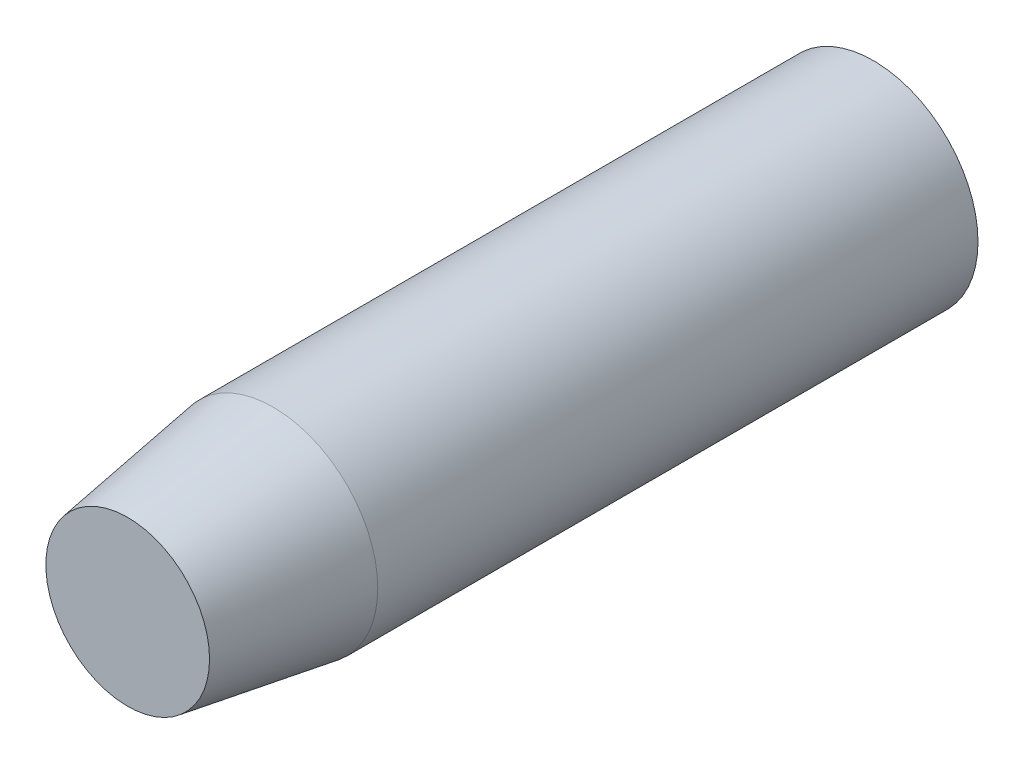
ISO-10303-21;
HEADER;
FILE_DESCRIPTION(('STEP AP214'),'2;1');
FILE_NAME('part.step','',(''),(''),'','','');
FILE_SCHEMA(('AUTOMOTIVE_DESIGN { 1 0 10303 214 1 1 1 1 }'));
ENDSEC;
DATA;
#1=APPLICATION_CONTEXT('core data for automotive mechanical design processes');
#2=APPLICATION_PROTOCOL_DEFINITION('international standard','automotive_design',2000,#1);
#3=PRODUCT_CONTEXT('',#1,'mechanical');
#4=PRODUCT('Part','Part','',(#3));
#5=PRODUCT_RELATED_PRODUCT_CATEGORY('part','',(#4));
#6=PRODUCT_DEFINITION_FORMATION('','',#4);
#7=PRODUCT_DEFINITION_CONTEXT('part definition',#1,'design');
#8=PRODUCT_DEFINITION('design','',#6,#7);
#9=PRODUCT_DEFINITION_SHAPE('','',#8);
#10=(LENGTH_UNIT() NAMED_UNIT(*) SI_UNIT(.MILLI.,.METRE.));
#11=(NAMED_UNIT(*) PLANE_ANGLE_UNIT() SI_UNIT($,.RADIAN.));
#12=(NAMED_UNIT(*) SI_UNIT($,.STERADIAN.) SOLID_ANGLE_UNIT());
#13=UNCERTAINTY_MEASURE_WITH_UNIT(LENGTH_MEASURE(1.E-05),#10,'distance_accuracy_value','');
#14=(GEOMETRIC_REPRESENTATION_CONTEXT(3) GLOBAL_UNCERTAINTY_ASSIGNED_CONTEXT((#13)) GLOBAL_UNIT_ASSIGNED_CONTEXT((#10,
#11,#12)) REPRESENTATION_CONTEXT('',''));
#15=CARTESIAN_POINT('',(0.,0.,0.));
#16=DIRECTION('',(0.,0.,1.));
#17=DIRECTION('',(1.,0.,0.));
#18=AXIS2_PLACEMENT_3D('',#15,#16,#17);
#19=CARTESIAN_POINT('',(0.,0.,65.0875));
#20=DIRECTION('',(0.,0.,-1.));
#21=DIRECTION('',(-1.,0.,0.));
#22=AXIS2_PLACEMENT_3D('',#19,#20,#21);
#23=CYLINDRICAL_SURFACE('',#22,18.25625);
#24=CARTESIAN_POINT('',(0.,0.,39.6874999999998));
#25=DIRECTION('',(0.,0.,1.));
#26=DIRECTION('',(1.,0.,0.));
#27=AXIS2_PLACEMENT_3D('',#24,#25,#26);
#28=CIRCLE('',#27,18.25625);
#29=CARTESIAN_POINT('',(18.25625,0.,39.6874999999998));
#30=VERTEX_POINT('',#29);
#31=EDGE_CURVE('E10',#30,#30,#28,.F.);
#32=ORIENTED_EDGE('',*,*,#31,.T.);
#33=EDGE_LOOP('',(#32));
#34=FACE_BOUND('',#33,.T.);
#35=CARTESIAN_POINT('',(0.,0.,-65.0875));
#36=DIRECTION('',(0.,0.,1.));
#37=DIRECTION('',(1.,0.,0.));
#38=AXIS2_PLACEMENT_3D('',#35,#36,#37);
#39=CIRCLE('',#38,18.25625);
#40=CARTESIAN_POINT('',(18.25625,0.,-65.0875));
#41=VERTEX_POINT('',#40);
#42=EDGE_CURVE('E42',#41,#41,#39,.T.);
#43=ORIENTED_EDGE('',*,*,#42,.T.);
#44=EDGE_LOOP('',(#43));
#45=FACE_BOUND('',#44,.T.);
#46=ADVANCED_FACE('F31',(#34,#45),#23,.T.);
#47=CARTESIAN_POINT('',(0.,0.,65.0875));
#48=DIRECTION('',(0.,0.,1.));
#49=DIRECTION('',(1.,0.,0.));
#50=AXIS2_PLACEMENT_3D('',#47,#48,#49);
#51=PLANE('',#50);
#52=CARTESIAN_POINT('',(0.,0.,65.0875));
#53=DIRECTION('',(0.,0.,1.));
#54=DIRECTION('',(1.,0.,0.));
#55=AXIS2_PLACEMENT_3D('',#52,#53,#54);
#56=CIRCLE('',#55,14.2875000000001);
#57=CARTESIAN_POINT('',(14.2875000000001,0.,65.0875));
#58=VERTEX_POINT('',#57);
#59=EDGE_CURVE('E38',#58,#58,#56,.T.);
#60=ORIENTED_EDGE('',*,*,#59,.T.);
#61=EDGE_LOOP('',(#60));
#62=FACE_BOUND('',#61,.T.);
#63=ADVANCED_FACE('F52',(#62),#51,.T.);
#64=CARTESIAN_POINT('',(0.,0.,-65.0875));
#65=DIRECTION('',(0.,0.,1.));
#66=DIRECTION('',(1.,0.,0.));
#67=AXIS2_PLACEMENT_3D('',#64,#65,#66);
#68=PLANE('',#67);
#69=ORIENTED_EDGE('',*,*,#42,.F.);
#70=EDGE_LOOP('',(#69));
#71=FACE_BOUND('',#70,.T.);
#72=ADVANCED_FACE('F50',(#71),#68,.F.);
#73=CARTESIAN_POINT('',(0.,0.,65.0875));
#74=DIRECTION('',(0.,0.,-1.));
#75=DIRECTION('',(-1.,0.,0.));
#76=AXIS2_PLACEMENT_3D('',#73,#74,#75);
#77=CONICAL_SURFACE('',#76,14.2875000000001,0.154996741923938);
#78=ORIENTED_EDGE('',*,*,#31,.F.);
#79=EDGE_LOOP('',(#78));
#80=FACE_BOUND('',#79,.T.);
#81=ORIENTED_EDGE('',*,*,#59,.F.);
#82=EDGE_LOOP('',(#81));
#83=FACE_BOUND('',#82,.T.);
#84=ADVANCED_FACE('F33',(#80,#83),#77,.T.);
#85=CLOSED_SHELL('',(#46,#63,#72,#84));
#86=MANIFOLD_SOLID_BREP('B2',#85);
#87=ADVANCED_BREP_SHAPE_REPRESENTATION('',(#18,#86),#14);
#88=SHAPE_DEFINITION_REPRESENTATION(#9,#87);
ENDSEC;
END-ISO-10303-21;
